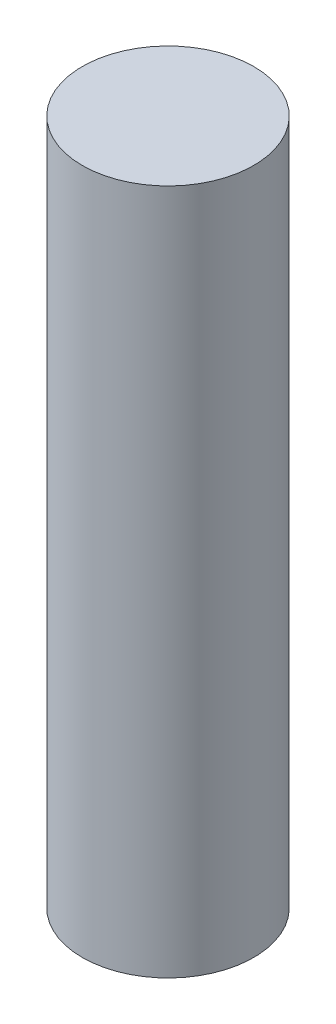
ISO-10303-21;
HEADER;
FILE_DESCRIPTION(('STEP AP214'),'2;1');
FILE_NAME('part.step','',(''),(''),'','','');
FILE_SCHEMA(('AUTOMOTIVE_DESIGN { 1 0 10303 214 1 1 1 1 }'));
ENDSEC;
DATA;
#1=APPLICATION_CONTEXT('core data for automotive mechanical design processes');
#2=APPLICATION_PROTOCOL_DEFINITION('international standard','automotive_design',2000,#1);
#3=PRODUCT_CONTEXT('',#1,'mechanical');
#4=PRODUCT('Part','Part','',(#3));
#5=PRODUCT_RELATED_PRODUCT_CATEGORY('part','',(#4));
#6=PRODUCT_DEFINITION_FORMATION('','',#4);
#7=PRODUCT_DEFINITION_CONTEXT('part definition',#1,'design');
#8=PRODUCT_DEFINITION('design','',#6,#7);
#9=PRODUCT_DEFINITION_SHAPE('','',#8);
#10=(LENGTH_UNIT() NAMED_UNIT(*) SI_UNIT(.MILLI.,.METRE.));
#11=(NAMED_UNIT(*) PLANE_ANGLE_UNIT() SI_UNIT($,.RADIAN.));
#12=(NAMED_UNIT(*) SI_UNIT($,.STERADIAN.) SOLID_ANGLE_UNIT());
#13=UNCERTAINTY_MEASURE_WITH_UNIT(LENGTH_MEASURE(1.E-05),#10,'distance_accuracy_value','');
#14=(GEOMETRIC_REPRESENTATION_CONTEXT(3) GLOBAL_UNCERTAINTY_ASSIGNED_CONTEXT((#13)) GLOBAL_UNIT_ASSIGNED_CONTEXT((#10,
#11,#12)) REPRESENTATION_CONTEXT('',''));
#15=CARTESIAN_POINT('',(0.,0.,0.));
#16=DIRECTION('',(0.,0.,1.));
#17=DIRECTION('',(1.,0.,0.));
#18=AXIS2_PLACEMENT_3D('',#15,#16,#17);
#19=CARTESIAN_POINT('',(0.,80.,0.));
#20=DIRECTION('',(0.,-1.,0.));
#21=DIRECTION('',(0.,0.,-1.));
#22=AXIS2_PLACEMENT_3D('',#19,#20,#21);
#23=CYLINDRICAL_SURFACE('',#22,10.);
#24=CARTESIAN_POINT('',(0.,80.,0.));
#25=DIRECTION('',(0.,1.,0.));
#26=DIRECTION('',(0.,0.,1.));
#27=AXIS2_PLACEMENT_3D('',#24,#25,#26);
#28=CIRCLE('',#27,10.);
#29=CARTESIAN_POINT('',(0.,80.,10.));
#30=VERTEX_POINT('',#29);
#31=EDGE_CURVE('E10',#30,#30,#28,.T.);
#32=ORIENTED_EDGE('',*,*,#31,.F.);
#33=EDGE_LOOP('',(#32));
#34=FACE_BOUND('',#33,.T.);
#35=CARTESIAN_POINT('',(0.,0.,0.));
#36=DIRECTION('',(0.,1.,0.));
#37=DIRECTION('',(0.,0.,1.));
#38=AXIS2_PLACEMENT_3D('',#35,#36,#37);
#39=CIRCLE('',#38,10.);
#40=CARTESIAN_POINT('',(0.,0.,10.));
#41=VERTEX_POINT('',#40);
#42=EDGE_CURVE('E35',#41,#41,#39,.T.);
#43=ORIENTED_EDGE('',*,*,#42,.T.);
#44=EDGE_LOOP('',(#43));
#45=FACE_BOUND('',#44,.T.);
#46=ADVANCED_FACE('F32',(#34,#45),#23,.T.);
#47=CARTESIAN_POINT('',(0.,80.,0.));
#48=DIRECTION('',(0.,1.,0.));
#49=DIRECTION('',(0.,0.,1.));
#50=AXIS2_PLACEMENT_3D('',#47,#48,#49);
#51=PLANE('',#50);
#52=ORIENTED_EDGE('',*,*,#31,.T.);
#53=EDGE_LOOP('',(#52));
#54=FACE_BOUND('',#53,.T.);
#55=ADVANCED_FACE('F47',(#54),#51,.T.);
#56=CARTESIAN_POINT('',(0.,0.,0.));
#57=DIRECTION('',(0.,1.,0.));
#58=DIRECTION('',(0.,0.,1.));
#59=AXIS2_PLACEMENT_3D('',#56,#57,#58);
#60=PLANE('',#59);
#61=ORIENTED_EDGE('',*,*,#42,.F.);
#62=EDGE_LOOP('',(#61));
#63=FACE_BOUND('',#62,.T.);
#64=ADVANCED_FACE('F45',(#63),#60,.F.);
#65=CLOSED_SHELL('',(#46,#55,#64));
#66=MANIFOLD_SOLID_BREP('B2',#65);
#67=ADVANCED_BREP_SHAPE_REPRESENTATION('',(#18,#66),#14);
#68=SHAPE_DEFINITION_REPRESENTATION(#9,#67);
ENDSEC;
END-ISO-10303-21;
